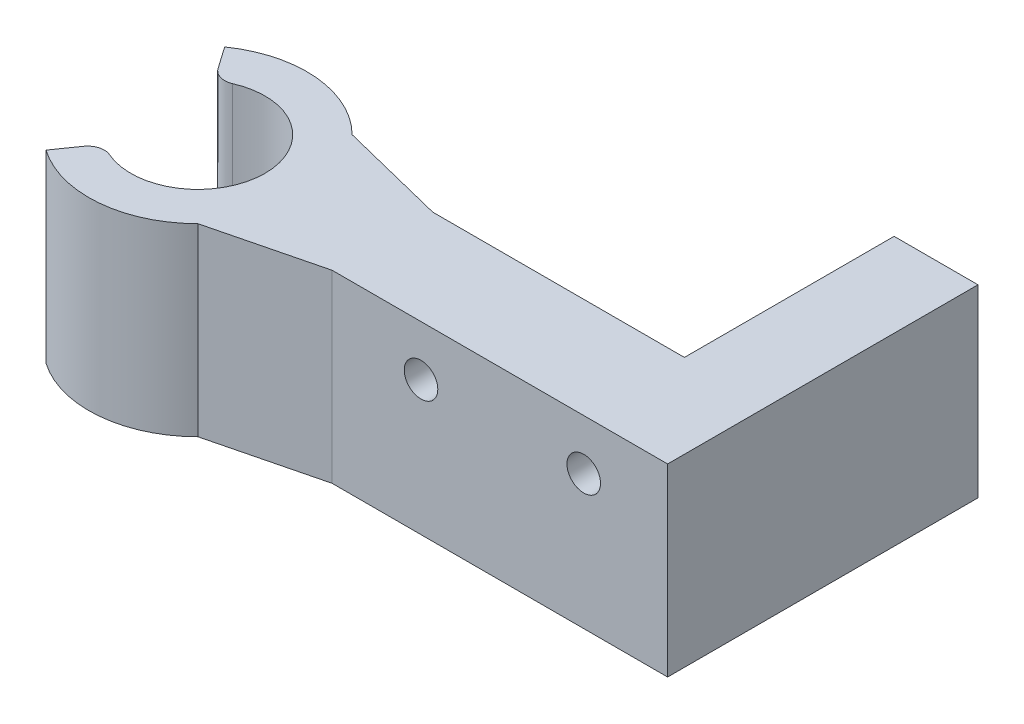
ISO-10303-21;
HEADER;
FILE_DESCRIPTION(('STEP AP214'),'2;1');
FILE_NAME('part.step','',(''),(''),'','','');
FILE_SCHEMA(('AUTOMOTIVE_DESIGN { 1 0 10303 214 1 1 1 1 }'));
ENDSEC;
DATA;
#1=APPLICATION_CONTEXT('core data for automotive mechanical design processes');
#2=APPLICATION_PROTOCOL_DEFINITION('international standard','automotive_design',2000,#1);
#3=PRODUCT_CONTEXT('',#1,'mechanical');
#4=PRODUCT('Part','Part','',(#3));
#5=PRODUCT_RELATED_PRODUCT_CATEGORY('part','',(#4));
#6=PRODUCT_DEFINITION_FORMATION('','',#4);
#7=PRODUCT_DEFINITION_CONTEXT('part definition',#1,'design');
#8=PRODUCT_DEFINITION('design','',#6,#7);
#9=PRODUCT_DEFINITION_SHAPE('','',#8);
#10=(LENGTH_UNIT() NAMED_UNIT(*) SI_UNIT(.MILLI.,.METRE.));
#11=(NAMED_UNIT(*) PLANE_ANGLE_UNIT() SI_UNIT($,.RADIAN.));
#12=(NAMED_UNIT(*) SI_UNIT($,.STERADIAN.) SOLID_ANGLE_UNIT());
#13=UNCERTAINTY_MEASURE_WITH_UNIT(LENGTH_MEASURE(1.E-05),#10,'distance_accuracy_value','');
#14=(GEOMETRIC_REPRESENTATION_CONTEXT(3) GLOBAL_UNCERTAINTY_ASSIGNED_CONTEXT((#13)) GLOBAL_UNIT_ASSIGNED_CONTEXT((#10,
#11,#12)) REPRESENTATION_CONTEXT('',''));
#15=CARTESIAN_POINT('',(0.,0.,0.));
#16=DIRECTION('',(0.,0.,1.));
#17=DIRECTION('',(1.,0.,0.));
#18=AXIS2_PLACEMENT_3D('',#15,#16,#17);
#19=CARTESIAN_POINT('',(0.,11.,-3.));
#20=DIRECTION('',(0.,0.,-1.));
#21=DIRECTION('',(-1.,0.,0.));
#22=AXIS2_PLACEMENT_3D('',#19,#20,#21);
#23=PLANE('',#22);
#24=DIRECTION('',(1.,0.,0.));
#25=VECTOR('',#24,1.);
#26=CARTESIAN_POINT('',(0.,11.,-3.));
#27=LINE('',#26,#25);
#28=CARTESIAN_POINT('',(11.,11.,-3.));
#29=VERTEX_POINT('',#28);
#30=CARTESIAN_POINT('',(26.,11.,-3.));
#31=VERTEX_POINT('',#30);
#32=EDGE_CURVE('E145',#29,#31,#27,.T.);
#33=ORIENTED_EDGE('',*,*,#32,.T.);
#34=DIRECTION('',(0.,1.,0.));
#35=VECTOR('',#34,1.);
#36=CARTESIAN_POINT('',(26.,11.,-3.));
#37=LINE('',#36,#35);
#38=CARTESIAN_POINT('',(26.,0.,-3.));
#39=VERTEX_POINT('',#38);
#40=EDGE_CURVE('E264',#39,#31,#37,.T.);
#41=ORIENTED_EDGE('',*,*,#40,.F.);
#42=DIRECTION('',(1.,0.,0.));
#43=VECTOR('',#42,1.);
#44=CARTESIAN_POINT('',(0.,0.,-3.));
#45=LINE('',#44,#43);
#46=CARTESIAN_POINT('',(11.,0.,-3.));
#47=VERTEX_POINT('',#46);
#48=EDGE_CURVE('E177',#47,#39,#45,.T.);
#49=ORIENTED_EDGE('',*,*,#48,.F.);
#50=DIRECTION('',(0.,-1.,0.));
#51=VECTOR('',#50,1.);
#52=CARTESIAN_POINT('',(11.,11.,-3.));
#53=LINE('',#52,#51);
#54=EDGE_CURVE('E135',#29,#47,#53,.T.);
#55=ORIENTED_EDGE('',*,*,#54,.F.);
#56=EDGE_LOOP('',(#33,#41,#49,#55));
#57=FACE_BOUND('',#56,.T.);
#58=ADVANCED_FACE('F35',(#57),#23,.T.);
#59=CARTESIAN_POINT('',(-1.99078715079902,11.,-4.58658549688257));
#60=DIRECTION('',(0.,-1.,0.));
#61=DIRECTION('',(0.,0.,-1.));
#62=AXIS2_PLACEMENT_3D('',#59,#60,#61);
#63=CYLINDRICAL_SURFACE('',#62,1.);
#64=CARTESIAN_POINT('',(-1.99078715079902,0.,-4.58658549688257));
#65=DIRECTION('',(0.,1.,0.));
#66=DIRECTION('',(0.,0.,1.));
#67=AXIS2_PLACEMENT_3D('',#64,#65,#66);
#68=CIRCLE('',#67,1.);
#69=CARTESIAN_POINT('',(-1.59262972063922,0.,-3.66926839750606));
#70=VERTEX_POINT('',#69);
#71=CARTESIAN_POINT('',(-2.80993919508801,0.,-4.01300906053153));
#72=VERTEX_POINT('',#71);
#73=EDGE_CURVE('E152',#70,#72,#68,.F.);
#74=ORIENTED_EDGE('',*,*,#73,.F.);
#75=DIRECTION('',(0.,-1.,0.));
#76=VECTOR('',#75,1.);
#77=CARTESIAN_POINT('',(-1.59262972063922,11.,-3.66926839750606));
#78=LINE('',#77,#76);
#79=CARTESIAN_POINT('',(-1.59262972063922,11.,-3.66926839750606));
#80=VERTEX_POINT('',#79);
#81=EDGE_CURVE('E11',#80,#70,#78,.T.);
#82=ORIENTED_EDGE('',*,*,#81,.F.);
#83=CARTESIAN_POINT('',(-1.99078715079902,11.,-4.58658549688257));
#84=DIRECTION('',(0.,1.,0.));
#85=DIRECTION('',(0.,0.,1.));
#86=AXIS2_PLACEMENT_3D('',#83,#84,#85);
#87=CIRCLE('',#86,1.);
#88=CARTESIAN_POINT('',(-2.80993919508801,11.,-4.01300906053153));
#89=VERTEX_POINT('',#88);
#90=EDGE_CURVE('E184',#80,#89,#87,.F.);
#91=ORIENTED_EDGE('',*,*,#90,.T.);
#92=DIRECTION('',(0.,-1.,0.));
#93=VECTOR('',#92,1.);
#94=CARTESIAN_POINT('',(-2.80993919508801,11.,-4.01300906053153));
#95=LINE('',#94,#93);
#96=EDGE_CURVE('E96',#89,#72,#95,.T.);
#97=ORIENTED_EDGE('',*,*,#96,.T.);
#98=EDGE_LOOP('',(#74,#82,#91,#97));
#99=FACE_BOUND('',#98,.T.);
#100=ADVANCED_FACE('F37',(#99),#63,.T.);
#101=CARTESIAN_POINT('',(0.,11.,0.));
#102=DIRECTION('',(0.,-1.,0.));
#103=DIRECTION('',(0.,0.,-1.));
#104=AXIS2_PLACEMENT_3D('',#101,#102,#103);
#105=CYLINDRICAL_SURFACE('',#104,4.);
#106=CARTESIAN_POINT('',(0.,0.,0.));
#107=DIRECTION('',(0.,1.,0.));
#108=DIRECTION('',(0.,0.,1.));
#109=AXIS2_PLACEMENT_3D('',#106,#107,#108);
#110=CIRCLE('',#109,4.);
#111=CARTESIAN_POINT('',(-1.59262972063924,0.,3.66926839750605));
#112=VERTEX_POINT('',#111);
#113=EDGE_CURVE('E155',#112,#70,#110,.T.);
#114=ORIENTED_EDGE('',*,*,#113,.F.);
#115=DIRECTION('',(0.,-1.,0.));
#116=VECTOR('',#115,1.);
#117=CARTESIAN_POINT('',(-1.59262972063924,11.,3.66926839750605));
#118=LINE('',#117,#116);
#119=CARTESIAN_POINT('',(-1.59262972063924,11.,3.66926839750605));
#120=VERTEX_POINT('',#119);
#121=EDGE_CURVE('E44',#120,#112,#118,.T.);
#122=ORIENTED_EDGE('',*,*,#121,.F.);
#123=CARTESIAN_POINT('',(0.,11.,0.));
#124=DIRECTION('',(0.,1.,0.));
#125=DIRECTION('',(0.,0.,1.));
#126=AXIS2_PLACEMENT_3D('',#123,#124,#125);
#127=CIRCLE('',#126,4.);
#128=EDGE_CURVE('E212',#120,#80,#127,.T.);
#129=ORIENTED_EDGE('',*,*,#128,.T.);
#130=ORIENTED_EDGE('',*,*,#81,.T.);
#131=EDGE_LOOP('',(#114,#122,#129,#130));
#132=FACE_BOUND('',#131,.T.);
#133=ADVANCED_FACE('F211',(#132),#105,.F.);
#134=CARTESIAN_POINT('',(-1.99078715079905,11.,4.58658549688256));
#135=DIRECTION('',(0.,-1.,0.));
#136=DIRECTION('',(0.,0.,-1.));
#137=AXIS2_PLACEMENT_3D('',#134,#135,#136);
#138=CYLINDRICAL_SURFACE('',#137,1.);
#139=CARTESIAN_POINT('',(-1.99078715079905,0.,4.58658549688256));
#140=DIRECTION('',(0.,1.,0.));
#141=DIRECTION('',(0.,0.,1.));
#142=AXIS2_PLACEMENT_3D('',#139,#140,#141);
#143=CIRCLE('',#142,1.);
#144=CARTESIAN_POINT('',(-2.80993919508804,0.,4.01300906053151));
#145=VERTEX_POINT('',#144);
#146=EDGE_CURVE('E159',#112,#145,#143,.T.);
#147=ORIENTED_EDGE('',*,*,#146,.T.);
#148=DIRECTION('',(0.,-1.,0.));
#149=VECTOR('',#148,1.);
#150=CARTESIAN_POINT('',(-2.80993919508804,11.,4.01300906053151));
#151=LINE('',#150,#149);
#152=CARTESIAN_POINT('',(-2.80993919508804,11.,4.01300906053151));
#153=VERTEX_POINT('',#152);
#154=EDGE_CURVE('E196',#153,#145,#151,.T.);
#155=ORIENTED_EDGE('',*,*,#154,.F.);
#156=CARTESIAN_POINT('',(-1.99078715079905,11.,4.58658549688256));
#157=DIRECTION('',(0.,1.,0.));
#158=DIRECTION('',(0.,0.,1.));
#159=AXIS2_PLACEMENT_3D('',#156,#157,#158);
#160=CIRCLE('',#159,1.);
#161=EDGE_CURVE('E202',#120,#153,#160,.T.);
#162=ORIENTED_EDGE('',*,*,#161,.F.);
#163=ORIENTED_EDGE('',*,*,#121,.T.);
#164=EDGE_LOOP('',(#147,#155,#162,#163));
#165=FACE_BOUND('',#164,.T.);
#166=ADVANCED_FACE('F200',(#165),#138,.T.);
#167=CARTESIAN_POINT('',(0.,11.,0.));
#168=DIRECTION('',(-0.819152044288991,0.,-0.573576436351047));
#169=DIRECTION('',(-0.573576436351047,0.,0.819152044288991));
#170=AXIS2_PLACEMENT_3D('',#167,#168,#169);
#171=PLANE('',#170);
#172=DIRECTION('',(0.573576436351047,0.,-0.819152044288991));
#173=VECTOR('',#172,1.);
#174=CARTESIAN_POINT('',(0.,0.,0.));
#175=LINE('',#174,#173);
#176=CARTESIAN_POINT('',(-3.72824683628181,0.,5.32448828787844));
#177=VERTEX_POINT('',#176);
#178=EDGE_CURVE('E162',#177,#145,#175,.T.);
#179=ORIENTED_EDGE('',*,*,#178,.F.);
#180=DIRECTION('',(0.,-1.,0.));
#181=VECTOR('',#180,1.);
#182=CARTESIAN_POINT('',(-3.72824683628181,11.,5.32448828787844));
#183=LINE('',#182,#181);
#184=CARTESIAN_POINT('',(-3.72824683628181,11.,5.32448828787844));
#185=VERTEX_POINT('',#184);
#186=EDGE_CURVE('E194',#185,#177,#183,.T.);
#187=ORIENTED_EDGE('',*,*,#186,.F.);
#188=DIRECTION('',(0.573576436351047,0.,-0.819152044288991));
#189=VECTOR('',#188,1.);
#190=CARTESIAN_POINT('',(0.,11.,0.));
#191=LINE('',#190,#189);
#192=EDGE_CURVE('E223',#185,#153,#191,.T.);
#193=ORIENTED_EDGE('',*,*,#192,.T.);
#194=ORIENTED_EDGE('',*,*,#154,.T.);
#195=EDGE_LOOP('',(#179,#187,#193,#194));
#196=FACE_BOUND('',#195,.T.);
#197=ADVANCED_FACE('F320',(#196),#171,.T.);
#198=CARTESIAN_POINT('',(0.,11.,0.));
#199=DIRECTION('',(0.,-1.,0.));
#200=DIRECTION('',(0.,0.,-1.));
#201=AXIS2_PLACEMENT_3D('',#198,#199,#200);
#202=CYLINDRICAL_SURFACE('',#201,6.5);
#203=CARTESIAN_POINT('',(0.,0.,0.));
#204=DIRECTION('',(0.,1.,0.));
#205=DIRECTION('',(0.,0.,1.));
#206=AXIS2_PLACEMENT_3D('',#203,#204,#205);
#207=CIRCLE('',#206,6.5);
#208=CARTESIAN_POINT('',(4.59619407771262,0.,4.5961940777125));
#209=VERTEX_POINT('',#208);
#210=EDGE_CURVE('E165',#177,#209,#207,.T.);
#211=ORIENTED_EDGE('',*,*,#210,.T.);
#212=DIRECTION('',(0.,-1.,0.));
#213=VECTOR('',#212,1.);
#214=CARTESIAN_POINT('',(4.59619407771262,11.,4.5961940777125));
#215=LINE('',#214,#213);
#216=CARTESIAN_POINT('',(4.59619407771262,11.,4.5961940777125));
#217=VERTEX_POINT('',#216);
#218=EDGE_CURVE('E192',#217,#209,#215,.T.);
#219=ORIENTED_EDGE('',*,*,#218,.F.);
#220=CARTESIAN_POINT('',(0.,11.,0.));
#221=DIRECTION('',(0.,1.,0.));
#222=DIRECTION('',(0.,0.,1.));
#223=AXIS2_PLACEMENT_3D('',#220,#221,#222);
#224=CIRCLE('',#223,6.5);
#225=EDGE_CURVE('E226',#185,#217,#224,.T.);
#226=ORIENTED_EDGE('',*,*,#225,.F.);
#227=ORIENTED_EDGE('',*,*,#186,.T.);
#228=EDGE_LOOP('',(#211,#219,#226,#227));
#229=FACE_BOUND('',#228,.T.);
#230=ADVANCED_FACE('F316',(#229),#202,.T.);
#231=CARTESIAN_POINT('',(1.34747404953795,11.,5.40596060281452));
#232=DIRECTION('',(0.241857121465639,0.,0.970311873985037));
#233=DIRECTION('',(0.970311873985037,0.,-0.241857121465639));
#234=AXIS2_PLACEMENT_3D('',#231,#232,#233);
#235=PLANE('',#234);
#236=DIRECTION('',(-0.970311873985038,0.,0.241857121465639));
#237=VECTOR('',#236,1.);
#238=CARTESIAN_POINT('',(1.34747404953795,0.,5.40596060281452));
#239=LINE('',#238,#237);
#240=CARTESIAN_POINT('',(11.,0.,3.));
#241=VERTEX_POINT('',#240);
#242=EDGE_CURVE('E168',#241,#209,#239,.T.);
#243=ORIENTED_EDGE('',*,*,#242,.F.);
#244=DIRECTION('',(0.,-1.,0.));
#245=VECTOR('',#244,1.);
#246=CARTESIAN_POINT('',(11.,11.,3.));
#247=LINE('',#246,#245);
#248=CARTESIAN_POINT('',(11.,11.,3.));
#249=VERTEX_POINT('',#248);
#250=EDGE_CURVE('E190',#249,#241,#247,.T.);
#251=ORIENTED_EDGE('',*,*,#250,.F.);
#252=DIRECTION('',(-0.970311873985038,0.,0.241857121465639));
#253=VECTOR('',#252,1.);
#254=CARTESIAN_POINT('',(1.34747404953795,11.,5.40596060281452));
#255=LINE('',#254,#253);
#256=EDGE_CURVE('E228',#249,#217,#255,.T.);
#257=ORIENTED_EDGE('',*,*,#256,.T.);
#258=ORIENTED_EDGE('',*,*,#218,.T.);
#259=EDGE_LOOP('',(#243,#251,#257,#258));
#260=FACE_BOUND('',#259,.T.);
#261=ADVANCED_FACE('F285',(#260),#235,.T.);
#262=CARTESIAN_POINT('',(0.,11.,3.));
#263=DIRECTION('',(0.,0.,-1.));
#264=DIRECTION('',(-1.,0.,0.));
#265=AXIS2_PLACEMENT_3D('',#262,#263,#264);
#266=PLANE('',#265);
#267=CARTESIAN_POINT('',(26.,8.,3.));
#268=DIRECTION('',(0.,0.,1.));
#269=DIRECTION('',(1.,0.,0.));
#270=AXIS2_PLACEMENT_3D('',#267,#268,#269);
#271=CIRCLE('',#270,1.);
#272=CARTESIAN_POINT('',(27.,8.,3.));
#273=VERTEX_POINT('',#272);
#274=EDGE_CURVE('E269',#273,#273,#271,.T.);
#275=ORIENTED_EDGE('',*,*,#274,.F.);
#276=EDGE_LOOP('',(#275));
#277=FACE_BOUND('',#276,.T.);
#278=CARTESIAN_POINT('',(16.3,8.,3.));
#279=DIRECTION('',(0.,0.,1.));
#280=DIRECTION('',(1.,0.,0.));
#281=AXIS2_PLACEMENT_3D('',#278,#279,#280);
#282=CIRCLE('',#281,1.);
#283=CARTESIAN_POINT('',(17.3,8.,3.));
#284=VERTEX_POINT('',#283);
#285=EDGE_CURVE('E219',#284,#284,#282,.T.);
#286=ORIENTED_EDGE('',*,*,#285,.F.);
#287=EDGE_LOOP('',(#286));
#288=FACE_BOUND('',#287,.T.);
#289=DIRECTION('',(1.,0.,0.));
#290=VECTOR('',#289,1.);
#291=CARTESIAN_POINT('',(0.,0.,3.));
#292=LINE('',#291,#290);
#293=CARTESIAN_POINT('',(31.,0.,3.));
#294=VERTEX_POINT('',#293);
#295=EDGE_CURVE('E171',#241,#294,#292,.T.);
#296=ORIENTED_EDGE('',*,*,#295,.T.);
#297=DIRECTION('',(0.,-1.,0.));
#298=VECTOR('',#297,1.);
#299=CARTESIAN_POINT('',(31.,11.,3.));
#300=LINE('',#299,#298);
#301=CARTESIAN_POINT('',(31.,11.,3.));
#302=VERTEX_POINT('',#301);
#303=EDGE_CURVE('E188',#302,#294,#300,.T.);
#304=ORIENTED_EDGE('',*,*,#303,.F.);
#305=DIRECTION('',(1.,0.,0.));
#306=VECTOR('',#305,1.);
#307=CARTESIAN_POINT('',(0.,11.,3.));
#308=LINE('',#307,#306);
#309=EDGE_CURVE('E231',#249,#302,#308,.T.);
#310=ORIENTED_EDGE('',*,*,#309,.F.);
#311=ORIENTED_EDGE('',*,*,#250,.T.);
#312=EDGE_LOOP('',(#296,#304,#310,#311));
#313=FACE_BOUND('',#312,.T.);
#314=ADVANCED_FACE('F282',(#277,#288,#313),#266,.F.);
#315=CARTESIAN_POINT('',(31.,11.,0.));
#316=DIRECTION('',(1.,0.,0.));
#317=DIRECTION('',(0.,0.,-1.));
#318=AXIS2_PLACEMENT_3D('',#315,#316,#317);
#319=PLANE('',#318);
#320=DIRECTION('',(0.,0.,1.));
#321=VECTOR('',#320,1.);
#322=CARTESIAN_POINT('',(31.,0.,0.));
#323=LINE('',#322,#321);
#324=CARTESIAN_POINT('',(31.,0.,-15.5));
#325=VERTEX_POINT('',#324);
#326=EDGE_CURVE('E174',#325,#294,#323,.T.);
#327=ORIENTED_EDGE('',*,*,#326,.F.);
#328=DIRECTION('',(0.,-1.,0.));
#329=VECTOR('',#328,1.);
#330=CARTESIAN_POINT('',(31.,11.,-15.5));
#331=LINE('',#330,#329);
#332=CARTESIAN_POINT('',(31.,11.,-15.5));
#333=VERTEX_POINT('',#332);
#334=EDGE_CURVE('E240',#333,#325,#331,.T.);
#335=ORIENTED_EDGE('',*,*,#334,.F.);
#336=DIRECTION('',(0.,0.,1.));
#337=VECTOR('',#336,1.);
#338=CARTESIAN_POINT('',(31.,11.,0.));
#339=LINE('',#338,#337);
#340=EDGE_CURVE('E147',#333,#302,#339,.T.);
#341=ORIENTED_EDGE('',*,*,#340,.T.);
#342=ORIENTED_EDGE('',*,*,#303,.T.);
#343=EDGE_LOOP('',(#327,#335,#341,#342));
#344=FACE_BOUND('',#343,.T.);
#345=ADVANCED_FACE('F237',(#344),#319,.T.);
#346=CARTESIAN_POINT('',(1.347474049538,11.,-5.40596060281458));
#347=DIRECTION('',(0.241857121465645,0.,-0.970311873985036));
#348=DIRECTION('',(-0.970311873985036,0.,-0.241857121465645));
#349=AXIS2_PLACEMENT_3D('',#346,#347,#348);
#350=PLANE('',#349);
#351=DIRECTION('',(0.970311873985036,0.,0.241857121465645));
#352=VECTOR('',#351,1.);
#353=CARTESIAN_POINT('',(1.347474049538,0.,-5.40596060281458));
#354=LINE('',#353,#352);
#355=CARTESIAN_POINT('',(4.59619407771255,0.,-4.59619407771257));
#356=VERTEX_POINT('',#355);
#357=EDGE_CURVE('E134',#356,#47,#354,.T.);
#358=ORIENTED_EDGE('',*,*,#357,.F.);
#359=DIRECTION('',(0.,-1.,0.));
#360=VECTOR('',#359,1.);
#361=CARTESIAN_POINT('',(4.59619407771255,11.,-4.59619407771257));
#362=LINE('',#361,#360);
#363=CARTESIAN_POINT('',(4.59619407771255,11.,-4.59619407771257));
#364=VERTEX_POINT('',#363);
#365=EDGE_CURVE('E128',#364,#356,#362,.T.);
#366=ORIENTED_EDGE('',*,*,#365,.F.);
#367=DIRECTION('',(0.970311873985036,0.,0.241857121465645));
#368=VECTOR('',#367,1.);
#369=CARTESIAN_POINT('',(1.347474049538,11.,-5.40596060281458));
#370=LINE('',#369,#368);
#371=EDGE_CURVE('E132',#364,#29,#370,.T.);
#372=ORIENTED_EDGE('',*,*,#371,.T.);
#373=ORIENTED_EDGE('',*,*,#54,.T.);
#374=EDGE_LOOP('',(#358,#366,#372,#373));
#375=FACE_BOUND('',#374,.T.);
#376=ADVANCED_FACE('F130',(#375),#350,.T.);
#377=CARTESIAN_POINT('',(0.,11.,0.));
#378=DIRECTION('',(0.,-1.,0.));
#379=DIRECTION('',(0.,0.,-1.));
#380=AXIS2_PLACEMENT_3D('',#377,#378,#379);
#381=CYLINDRICAL_SURFACE('',#380,6.5);
#382=CARTESIAN_POINT('',(0.,0.,0.));
#383=DIRECTION('',(0.,1.,0.));
#384=DIRECTION('',(0.,0.,1.));
#385=AXIS2_PLACEMENT_3D('',#382,#383,#384);
#386=CIRCLE('',#385,6.5);
#387=CARTESIAN_POINT('',(-3.72824683628177,0.,-5.32448828787847));
#388=VERTEX_POINT('',#387);
#389=EDGE_CURVE('E89',#356,#388,#386,.T.);
#390=ORIENTED_EDGE('',*,*,#389,.T.);
#391=DIRECTION('',(0.,-1.,0.));
#392=VECTOR('',#391,1.);
#393=CARTESIAN_POINT('',(-3.72824683628177,11.,-5.32448828787847));
#394=LINE('',#393,#392);
#395=CARTESIAN_POINT('',(-3.72824683628177,11.,-5.32448828787847));
#396=VERTEX_POINT('',#395);
#397=EDGE_CURVE('E136',#396,#388,#394,.T.);
#398=ORIENTED_EDGE('',*,*,#397,.F.);
#399=CARTESIAN_POINT('',(0.,11.,0.));
#400=DIRECTION('',(0.,1.,0.));
#401=DIRECTION('',(0.,0.,1.));
#402=AXIS2_PLACEMENT_3D('',#399,#400,#401);
#403=CIRCLE('',#402,6.5);
#404=EDGE_CURVE('E138',#364,#396,#403,.T.);
#405=ORIENTED_EDGE('',*,*,#404,.F.);
#406=ORIENTED_EDGE('',*,*,#365,.T.);
#407=EDGE_LOOP('',(#390,#398,#405,#406));
#408=FACE_BOUND('',#407,.T.);
#409=ADVANCED_FACE('F139',(#408),#381,.T.);
#410=CARTESIAN_POINT('',(0.,11.,0.));
#411=DIRECTION('',(0.819152044288995,0.,-0.573576436351042));
#412=DIRECTION('',(-0.573576436351042,0.,-0.819152044288995));
#413=AXIS2_PLACEMENT_3D('',#410,#411,#412);
#414=PLANE('',#413);
#415=DIRECTION('',(0.573576436351042,0.,0.819152044288995));
#416=VECTOR('',#415,1.);
#417=CARTESIAN_POINT('',(0.,0.,0.));
#418=LINE('',#417,#416);
#419=EDGE_CURVE('E182',#388,#72,#418,.T.);
#420=ORIENTED_EDGE('',*,*,#419,.T.);
#421=ORIENTED_EDGE('',*,*,#96,.F.);
#422=DIRECTION('',(0.573576436351042,0.,0.819152044288995));
#423=VECTOR('',#422,1.);
#424=CARTESIAN_POINT('',(0.,11.,0.));
#425=LINE('',#424,#423);
#426=EDGE_CURVE('E52',#396,#89,#425,.T.);
#427=ORIENTED_EDGE('',*,*,#426,.F.);
#428=ORIENTED_EDGE('',*,*,#397,.T.);
#429=EDGE_LOOP('',(#420,#421,#427,#428));
#430=FACE_BOUND('',#429,.T.);
#431=ADVANCED_FACE('F215',(#430),#414,.F.);
#432=CARTESIAN_POINT('',(0.,11.,0.));
#433=DIRECTION('',(0.,1.,0.));
#434=DIRECTION('',(0.,0.,1.));
#435=AXIS2_PLACEMENT_3D('',#432,#433,#434);
#436=PLANE('',#435);
#437=ORIENTED_EDGE('',*,*,#90,.F.);
#438=ORIENTED_EDGE('',*,*,#128,.F.);
#439=ORIENTED_EDGE('',*,*,#161,.T.);
#440=ORIENTED_EDGE('',*,*,#192,.F.);
#441=ORIENTED_EDGE('',*,*,#225,.T.);
#442=ORIENTED_EDGE('',*,*,#256,.F.);
#443=ORIENTED_EDGE('',*,*,#309,.T.);
#444=ORIENTED_EDGE('',*,*,#340,.F.);
#445=DIRECTION('',(1.,0.,0.));
#446=VECTOR('',#445,1.);
#447=CARTESIAN_POINT('',(26.,11.,-15.5));
#448=LINE('',#447,#446);
#449=CARTESIAN_POINT('',(26.,11.,-15.5));
#450=VERTEX_POINT('',#449);
#451=EDGE_CURVE('E244',#450,#333,#448,.T.);
#452=ORIENTED_EDGE('',*,*,#451,.F.);
#453=DIRECTION('',(0.,0.,1.));
#454=VECTOR('',#453,1.);
#455=CARTESIAN_POINT('',(26.,11.,-15.5));
#456=LINE('',#455,#454);
#457=EDGE_CURVE('E256',#450,#31,#456,.T.);
#458=ORIENTED_EDGE('',*,*,#457,.T.);
#459=ORIENTED_EDGE('',*,*,#32,.F.);
#460=ORIENTED_EDGE('',*,*,#371,.F.);
#461=ORIENTED_EDGE('',*,*,#404,.T.);
#462=ORIENTED_EDGE('',*,*,#426,.T.);
#463=EDGE_LOOP('',(#437,#438,#439,#440,#441,#442,#443,#444,#452,#458,#459,#460,#461,#462));
#464=FACE_BOUND('',#463,.T.);
#465=ADVANCED_FACE('F142',(#464),#436,.T.);
#466=CARTESIAN_POINT('',(0.,0.,0.));
#467=DIRECTION('',(0.,1.,0.));
#468=DIRECTION('',(0.,0.,1.));
#469=AXIS2_PLACEMENT_3D('',#466,#467,#468);
#470=PLANE('',#469);
#471=ORIENTED_EDGE('',*,*,#73,.T.);
#472=ORIENTED_EDGE('',*,*,#419,.F.);
#473=ORIENTED_EDGE('',*,*,#389,.F.);
#474=ORIENTED_EDGE('',*,*,#357,.T.);
#475=ORIENTED_EDGE('',*,*,#48,.T.);
#476=DIRECTION('',(0.,0.,1.));
#477=VECTOR('',#476,1.);
#478=CARTESIAN_POINT('',(26.,0.,-15.5));
#479=LINE('',#478,#477);
#480=CARTESIAN_POINT('',(26.,0.,-15.5));
#481=VERTEX_POINT('',#480);
#482=EDGE_CURVE('E258',#481,#39,#479,.T.);
#483=ORIENTED_EDGE('',*,*,#482,.F.);
#484=DIRECTION('',(-1.,0.,0.));
#485=VECTOR('',#484,1.);
#486=CARTESIAN_POINT('',(26.,0.,-15.5));
#487=LINE('',#486,#485);
#488=EDGE_CURVE('E260',#325,#481,#487,.T.);
#489=ORIENTED_EDGE('',*,*,#488,.F.);
#490=ORIENTED_EDGE('',*,*,#326,.T.);
#491=ORIENTED_EDGE('',*,*,#295,.F.);
#492=ORIENTED_EDGE('',*,*,#242,.T.);
#493=ORIENTED_EDGE('',*,*,#210,.F.);
#494=ORIENTED_EDGE('',*,*,#178,.T.);
#495=ORIENTED_EDGE('',*,*,#146,.F.);
#496=ORIENTED_EDGE('',*,*,#113,.T.);
#497=EDGE_LOOP('',(#471,#472,#473,#474,#475,#483,#489,#490,#491,#492,#493,#494,#495,#496));
#498=FACE_BOUND('',#497,.T.);
#499=ADVANCED_FACE('F208',(#498),#470,.F.);
#500=CARTESIAN_POINT('',(16.3,8.,-1.));
#501=DIRECTION('',(0.,0.,1.));
#502=DIRECTION('',(1.,0.,0.));
#503=AXIS2_PLACEMENT_3D('',#500,#501,#502);
#504=CYLINDRICAL_SURFACE('',#503,1.);
#505=CARTESIAN_POINT('',(16.3,8.,-1.));
#506=DIRECTION('',(0.,0.,1.));
#507=DIRECTION('',(1.,0.,0.));
#508=AXIS2_PLACEMENT_3D('',#505,#506,#507);
#509=CIRCLE('',#508,1.);
#510=CARTESIAN_POINT('',(17.3,8.,-1.));
#511=VERTEX_POINT('',#510);
#512=EDGE_CURVE('E156',#511,#511,#509,.T.);
#513=ORIENTED_EDGE('',*,*,#512,.F.);
#514=EDGE_LOOP('',(#513));
#515=FACE_BOUND('',#514,.T.);
#516=ORIENTED_EDGE('',*,*,#285,.T.);
#517=EDGE_LOOP('',(#516));
#518=FACE_BOUND('',#517,.T.);
#519=ADVANCED_FACE('F280',(#515,#518),#504,.F.);
#520=CARTESIAN_POINT('',(16.3,8.,-1.));
#521=DIRECTION('',(0.,0.,1.));
#522=DIRECTION('',(1.,0.,0.));
#523=AXIS2_PLACEMENT_3D('',#520,#521,#522);
#524=PLANE('',#523);
#525=ORIENTED_EDGE('',*,*,#512,.T.);
#526=EDGE_LOOP('',(#525));
#527=FACE_BOUND('',#526,.T.);
#528=ADVANCED_FACE('F397',(#527),#524,.T.);
#529=CARTESIAN_POINT('',(26.,8.,-1.));
#530=DIRECTION('',(0.,0.,1.));
#531=DIRECTION('',(1.,0.,0.));
#532=AXIS2_PLACEMENT_3D('',#529,#530,#531);
#533=CYLINDRICAL_SURFACE('',#532,1.);
#534=CARTESIAN_POINT('',(26.,8.,-1.));
#535=DIRECTION('',(0.,0.,1.));
#536=DIRECTION('',(1.,0.,0.));
#537=AXIS2_PLACEMENT_3D('',#534,#535,#536);
#538=CIRCLE('',#537,1.);
#539=CARTESIAN_POINT('',(27.,8.,-1.));
#540=VERTEX_POINT('',#539);
#541=EDGE_CURVE('E270',#540,#540,#538,.T.);
#542=ORIENTED_EDGE('',*,*,#541,.F.);
#543=EDGE_LOOP('',(#542));
#544=FACE_BOUND('',#543,.T.);
#545=ORIENTED_EDGE('',*,*,#274,.T.);
#546=EDGE_LOOP('',(#545));
#547=FACE_BOUND('',#546,.T.);
#548=ADVANCED_FACE('F405',(#544,#547),#533,.F.);
#549=CARTESIAN_POINT('',(26.,8.,-1.));
#550=DIRECTION('',(0.,0.,1.));
#551=DIRECTION('',(1.,0.,0.));
#552=AXIS2_PLACEMENT_3D('',#549,#550,#551);
#553=PLANE('',#552);
#554=ORIENTED_EDGE('',*,*,#541,.T.);
#555=EDGE_LOOP('',(#554));
#556=FACE_BOUND('',#555,.T.);
#557=ADVANCED_FACE('F412',(#556),#553,.T.);
#558=CARTESIAN_POINT('',(26.,11.,-15.5));
#559=DIRECTION('',(1.,0.,0.));
#560=DIRECTION('',(0.,0.,-1.));
#561=AXIS2_PLACEMENT_3D('',#558,#559,#560);
#562=PLANE('',#561);
#563=ORIENTED_EDGE('',*,*,#40,.T.);
#564=ORIENTED_EDGE('',*,*,#457,.F.);
#565=DIRECTION('',(0.,1.,0.));
#566=VECTOR('',#565,1.);
#567=CARTESIAN_POINT('',(26.,11.,-15.5));
#568=LINE('',#567,#566);
#569=EDGE_CURVE('E254',#481,#450,#568,.T.);
#570=ORIENTED_EDGE('',*,*,#569,.F.);
#571=ORIENTED_EDGE('',*,*,#482,.T.);
#572=EDGE_LOOP('',(#563,#564,#570,#571));
#573=FACE_BOUND('',#572,.T.);
#574=ADVANCED_FACE('F299',(#573),#562,.F.);
#575=CARTESIAN_POINT('',(0.,0.,-15.5));
#576=DIRECTION('',(0.,0.,1.));
#577=DIRECTION('',(1.,0.,0.));
#578=AXIS2_PLACEMENT_3D('',#575,#576,#577);
#579=PLANE('',#578);
#580=ORIENTED_EDGE('',*,*,#334,.T.);
#581=ORIENTED_EDGE('',*,*,#488,.T.);
#582=ORIENTED_EDGE('',*,*,#569,.T.);
#583=ORIENTED_EDGE('',*,*,#451,.T.);
#584=EDGE_LOOP('',(#580,#581,#582,#583));
#585=FACE_BOUND('',#584,.T.);
#586=ADVANCED_FACE('F250',(#585),#579,.F.);
#587=CLOSED_SHELL('',(#58,#100,#133,#166,#197,#230,#261,#314,#345,#376,#409,#431,#465,#499,#519,
#528,#548,#557,#574,#586));
#588=MANIFOLD_SOLID_BREP('B2',#587);
#589=ADVANCED_BREP_SHAPE_REPRESENTATION('',(#18,#588),#14);
#590=SHAPE_DEFINITION_REPRESENTATION(#9,#589);
ENDSEC;
END-ISO-10303-21;
